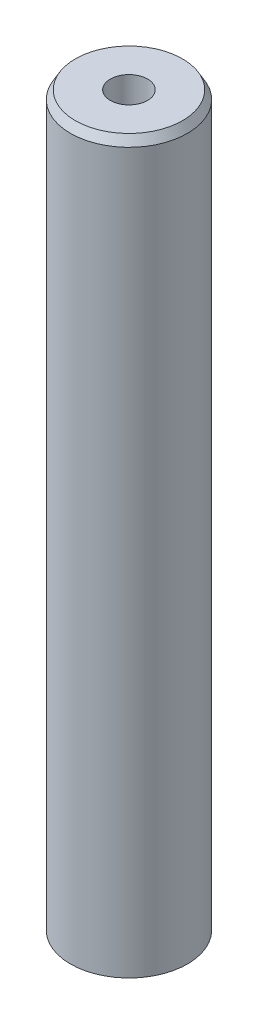
ISO-10303-21;
HEADER;
FILE_DESCRIPTION(('STEP AP214'),'2;1');
FILE_NAME('part.step','',(''),(''),'','','');
FILE_SCHEMA(('AUTOMOTIVE_DESIGN { 1 0 10303 214 1 1 1 1 }'));
ENDSEC;
DATA;
#1=APPLICATION_CONTEXT('core data for automotive mechanical design processes');
#2=APPLICATION_PROTOCOL_DEFINITION('international standard','automotive_design',2000,#1);
#3=PRODUCT_CONTEXT('',#1,'mechanical');
#4=PRODUCT('Part','Part','',(#3));
#5=PRODUCT_RELATED_PRODUCT_CATEGORY('part','',(#4));
#6=PRODUCT_DEFINITION_FORMATION('','',#4);
#7=PRODUCT_DEFINITION_CONTEXT('part definition',#1,'design');
#8=PRODUCT_DEFINITION('design','',#6,#7);
#9=PRODUCT_DEFINITION_SHAPE('','',#8);
#10=(LENGTH_UNIT() NAMED_UNIT(*) SI_UNIT(.MILLI.,.METRE.));
#11=(NAMED_UNIT(*) PLANE_ANGLE_UNIT() SI_UNIT($,.RADIAN.));
#12=(NAMED_UNIT(*) SI_UNIT($,.STERADIAN.) SOLID_ANGLE_UNIT());
#13=UNCERTAINTY_MEASURE_WITH_UNIT(LENGTH_MEASURE(1.E-05),#10,'distance_accuracy_value','');
#14=(GEOMETRIC_REPRESENTATION_CONTEXT(3) GLOBAL_UNCERTAINTY_ASSIGNED_CONTEXT((#13)) GLOBAL_UNIT_ASSIGNED_CONTEXT((#10,
#11,#12)) REPRESENTATION_CONTEXT('',''));
#15=CARTESIAN_POINT('',(0.,0.,0.));
#16=DIRECTION('',(0.,0.,1.));
#17=DIRECTION('',(1.,0.,0.));
#18=AXIS2_PLACEMENT_3D('',#15,#16,#17);
#19=CARTESIAN_POINT('',(0.,375.821542556053,0.));
#20=DIRECTION('',(0.,-1.,0.));
#21=DIRECTION('',(0.,0.,-1.));
#22=AXIS2_PLACEMENT_3D('',#19,#20,#21);
#23=CYLINDRICAL_SURFACE('',#22,30.);
#24=CARTESIAN_POINT('',(0.,371.448787622468,0.));
#25=DIRECTION('',(0.,1.,0.));
#26=DIRECTION('',(0.,0.,1.));
#27=AXIS2_PLACEMENT_3D('',#24,#25,#26);
#28=CIRCLE('',#27,30.);
#29=CARTESIAN_POINT('',(0.,371.448787622468,30.));
#30=VERTEX_POINT('',#29);
#31=EDGE_CURVE('E50',#30,#30,#28,.F.);
#32=ORIENTED_EDGE('',*,*,#31,.T.);
#33=EDGE_LOOP('',(#32));
#34=FACE_BOUND('',#33,.T.);
#35=CARTESIAN_POINT('',(0.,2.52461123800585,0.));
#36=DIRECTION('',(0.,1.,0.));
#37=DIRECTION('',(0.,0.,1.));
#38=AXIS2_PLACEMENT_3D('',#35,#36,#37);
#39=CIRCLE('',#38,30.);
#40=CARTESIAN_POINT('',(0.,2.52461123800585,30.));
#41=VERTEX_POINT('',#40);
#42=EDGE_CURVE('E51',#41,#41,#39,.T.);
#43=ORIENTED_EDGE('',*,*,#42,.T.);
#44=EDGE_LOOP('',(#43));
#45=FACE_BOUND('',#44,.T.);
#46=ADVANCED_FACE('F39',(#34,#45),#23,.T.);
#47=CARTESIAN_POINT('',(0.,375.821542556053,0.));
#48=DIRECTION('',(0.,1.,0.));
#49=DIRECTION('',(0.,0.,1.));
#50=AXIS2_PLACEMENT_3D('',#47,#48,#49);
#51=PLANE('',#50);
#52=CARTESIAN_POINT('',(0.,375.821542556053,0.));
#53=DIRECTION('',(0.,1.,0.));
#54=DIRECTION('',(0.,0.,1.));
#55=AXIS2_PLACEMENT_3D('',#52,#53,#54);
#56=CIRCLE('',#55,27.4753887619942);
#57=CARTESIAN_POINT('',(0.,375.821542556053,27.4753887619942));
#58=VERTEX_POINT('',#57);
#59=EDGE_CURVE('E54',#58,#58,#56,.T.);
#60=ORIENTED_EDGE('',*,*,#59,.T.);
#61=EDGE_LOOP('',(#60));
#62=FACE_BOUND('',#61,.T.);
#63=CARTESIAN_POINT('',(0.,375.821542556053,0.));
#64=DIRECTION('',(0.,1.,0.));
#65=DIRECTION('',(0.,0.,1.));
#66=AXIS2_PLACEMENT_3D('',#63,#64,#65);
#67=CIRCLE('',#66,9.5392758947858);
#68=CARTESIAN_POINT('',(0.,375.821542556053,9.5392758947858));
#69=VERTEX_POINT('',#68);
#70=EDGE_CURVE('E58',#69,#69,#67,.T.);
#71=ORIENTED_EDGE('',*,*,#70,.F.);
#72=EDGE_LOOP('',(#71));
#73=FACE_BOUND('',#72,.T.);
#74=ADVANCED_FACE('F69',(#62,#73),#51,.T.);
#75=CARTESIAN_POINT('',(0.,0.,0.));
#76=DIRECTION('',(0.,1.,0.));
#77=DIRECTION('',(0.,0.,1.));
#78=AXIS2_PLACEMENT_3D('',#75,#76,#77);
#79=PLANE('',#78);
#80=CARTESIAN_POINT('',(0.,0.,0.));
#81=DIRECTION('',(0.,1.,0.));
#82=DIRECTION('',(0.,0.,1.));
#83=AXIS2_PLACEMENT_3D('',#80,#81,#82);
#84=CIRCLE('',#83,25.6272450664144);
#85=CARTESIAN_POINT('',(0.,0.,25.6272450664144));
#86=VERTEX_POINT('',#85);
#87=EDGE_CURVE('E10',#86,#86,#84,.F.);
#88=ORIENTED_EDGE('',*,*,#87,.T.);
#89=EDGE_LOOP('',(#88));
#90=FACE_BOUND('',#89,.T.);
#91=CARTESIAN_POINT('',(0.,0.,0.));
#92=DIRECTION('',(0.,1.,0.));
#93=DIRECTION('',(0.,0.,1.));
#94=AXIS2_PLACEMENT_3D('',#91,#92,#93);
#95=CIRCLE('',#94,9.5392758947858);
#96=CARTESIAN_POINT('',(0.,0.,9.5392758947858));
#97=VERTEX_POINT('',#96);
#98=EDGE_CURVE('E63',#97,#97,#95,.T.);
#99=ORIENTED_EDGE('',*,*,#98,.T.);
#100=EDGE_LOOP('',(#99));
#101=FACE_BOUND('',#100,.T.);
#102=ADVANCED_FACE('F75',(#90,#101),#79,.F.);
#103=CARTESIAN_POINT('',(0.,375.821542556053,0.));
#104=DIRECTION('',(0.,-1.,0.));
#105=DIRECTION('',(0.,0.,-1.));
#106=AXIS2_PLACEMENT_3D('',#103,#104,#105);
#107=CYLINDRICAL_SURFACE('',#106,9.5392758947858);
#108=ORIENTED_EDGE('',*,*,#70,.T.);
#109=EDGE_LOOP('',(#108));
#110=FACE_BOUND('',#109,.T.);
#111=ORIENTED_EDGE('',*,*,#98,.F.);
#112=EDGE_LOOP('',(#111));
#113=FACE_BOUND('',#112,.T.);
#114=ADVANCED_FACE('F70',(#110,#113),#107,.F.);
#115=CARTESIAN_POINT('',(0.,375.821542556053,0.));
#116=DIRECTION('',(0.,-1.,0.));
#117=DIRECTION('',(0.,0.,-1.));
#118=AXIS2_PLACEMENT_3D('',#115,#116,#117);
#119=CONICAL_SURFACE('',#118,27.4753887619942,0.523598775598292);
#120=ORIENTED_EDGE('',*,*,#31,.F.);
#121=EDGE_LOOP('',(#120));
#122=FACE_BOUND('',#121,.T.);
#123=ORIENTED_EDGE('',*,*,#59,.F.);
#124=EDGE_LOOP('',(#123));
#125=FACE_BOUND('',#124,.T.);
#126=ADVANCED_FACE('F81',(#122,#125),#119,.T.);
#127=CARTESIAN_POINT('',(0.,2.52461123800585,0.));
#128=DIRECTION('',(0.,1.,0.));
#129=DIRECTION('',(0.,0.,1.));
#130=AXIS2_PLACEMENT_3D('',#127,#128,#129);
#131=CONICAL_SURFACE('',#130,30.,1.0471975511966);
#132=ORIENTED_EDGE('',*,*,#87,.F.);
#133=EDGE_LOOP('',(#132));
#134=FACE_BOUND('',#133,.T.);
#135=ORIENTED_EDGE('',*,*,#42,.F.);
#136=EDGE_LOOP('',(#135));
#137=FACE_BOUND('',#136,.T.);
#138=ADVANCED_FACE('F45',(#134,#137),#131,.T.);
#139=CLOSED_SHELL('',(#46,#74,#102,#114,#126,#138));
#140=MANIFOLD_SOLID_BREP('B2',#139);
#141=ADVANCED_BREP_SHAPE_REPRESENTATION('',(#18,#140),#14);
#142=SHAPE_DEFINITION_REPRESENTATION(#9,#141);
ENDSEC;
END-ISO-10303-21;
